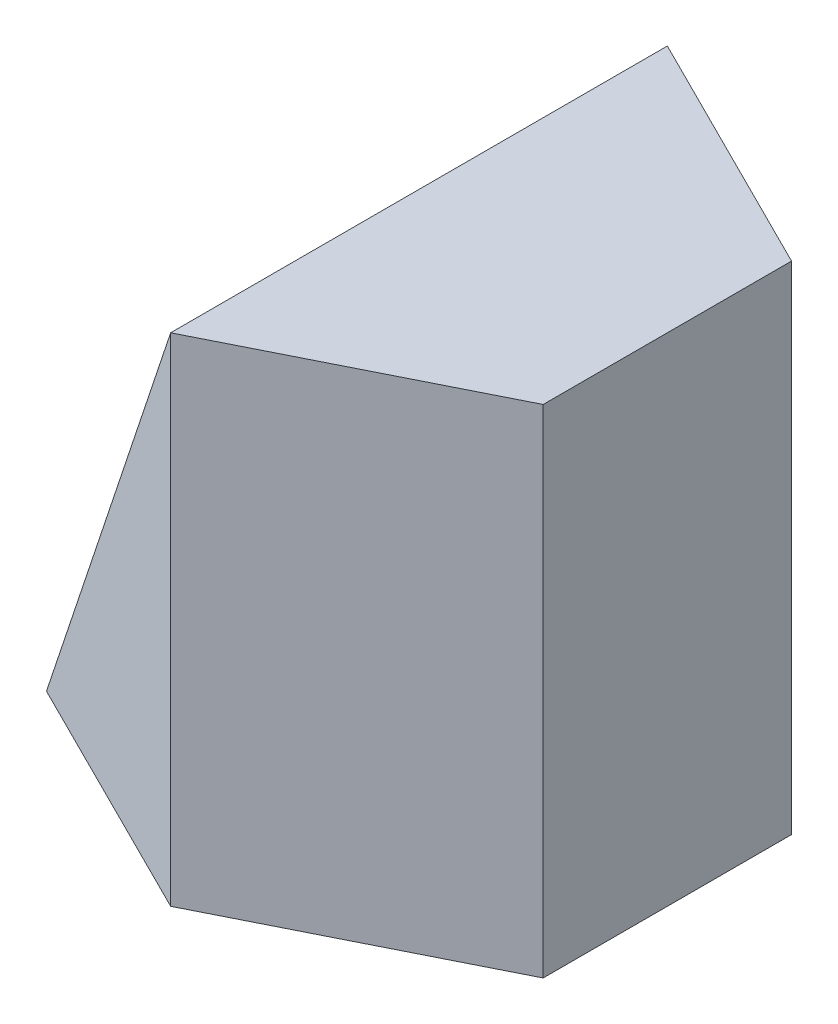
ISO-10303-21;
HEADER;
FILE_DESCRIPTION(('STEP AP214'),'2;1');
FILE_NAME('part.step','',(''),(''),'','','');
FILE_SCHEMA(('AUTOMOTIVE_DESIGN { 1 0 10303 214 1 1 1 1 }'));
ENDSEC;
DATA;
#1=APPLICATION_CONTEXT('core data for automotive mechanical design processes');
#2=APPLICATION_PROTOCOL_DEFINITION('international standard','automotive_design',2000,#1);
#3=PRODUCT_CONTEXT('',#1,'mechanical');
#4=PRODUCT('Part','Part','',(#3));
#5=PRODUCT_RELATED_PRODUCT_CATEGORY('part','',(#4));
#6=PRODUCT_DEFINITION_FORMATION('','',#4);
#7=PRODUCT_DEFINITION_CONTEXT('part definition',#1,'design');
#8=PRODUCT_DEFINITION('design','',#6,#7);
#9=PRODUCT_DEFINITION_SHAPE('','',#8);
#10=(LENGTH_UNIT() NAMED_UNIT(*) SI_UNIT(.MILLI.,.METRE.));
#11=(NAMED_UNIT(*) PLANE_ANGLE_UNIT() SI_UNIT($,.RADIAN.));
#12=(NAMED_UNIT(*) SI_UNIT($,.STERADIAN.) SOLID_ANGLE_UNIT());
#13=UNCERTAINTY_MEASURE_WITH_UNIT(LENGTH_MEASURE(1.E-05),#10,'distance_accuracy_value','');
#14=(GEOMETRIC_REPRESENTATION_CONTEXT(3) GLOBAL_UNCERTAINTY_ASSIGNED_CONTEXT((#13)) GLOBAL_UNIT_ASSIGNED_CONTEXT((#10,
#11,#12)) REPRESENTATION_CONTEXT('',''));
#15=CARTESIAN_POINT('',(0.,0.,0.));
#16=DIRECTION('',(0.,0.,1.));
#17=DIRECTION('',(1.,0.,0.));
#18=AXIS2_PLACEMENT_3D('',#15,#16,#17);
#19=CARTESIAN_POINT('',(0.,0.,40.));
#20=DIRECTION('',(0.,1.,0.));
#21=DIRECTION('',(0.,0.,1.));
#22=AXIS2_PLACEMENT_3D('',#19,#20,#21);
#23=PLANE('',#22);
#24=DIRECTION('',(0.894427190999916,0.,0.447213595499958));
#25=VECTOR('',#24,1.);
#26=CARTESIAN_POINT('',(4.,0.,-8.));
#27=LINE('',#26,#25);
#28=CARTESIAN_POINT('',(20.,0.,0.));
#29=VERTEX_POINT('',#28);
#30=CARTESIAN_POINT('',(40.,0.,10.));
#31=VERTEX_POINT('',#30);
#32=EDGE_CURVE('E118',#29,#31,#27,.T.);
#33=ORIENTED_EDGE('',*,*,#32,.T.);
#34=DIRECTION('',(0.,0.,-1.));
#35=VECTOR('',#34,1.);
#36=CARTESIAN_POINT('',(40.,0.,40.));
#37=LINE('',#36,#35);
#38=CARTESIAN_POINT('',(40.,0.,30.));
#39=VERTEX_POINT('',#38);
#40=EDGE_CURVE('E129',#39,#31,#37,.T.);
#41=ORIENTED_EDGE('',*,*,#40,.F.);
#42=DIRECTION('',(0.894427190999916,0.,-0.447213595499958));
#43=VECTOR('',#42,1.);
#44=CARTESIAN_POINT('',(20.,0.,40.));
#45=LINE('',#44,#43);
#46=CARTESIAN_POINT('',(20.,0.,40.));
#47=VERTEX_POINT('',#46);
#48=EDGE_CURVE('E161',#47,#39,#45,.T.);
#49=ORIENTED_EDGE('',*,*,#48,.F.);
#50=DIRECTION('',(0.894427190999916,0.,0.447213595499958));
#51=VECTOR('',#50,1.);
#52=CARTESIAN_POINT('',(-12.,0.,24.));
#53=LINE('',#52,#51);
#54=CARTESIAN_POINT('',(0.,0.,30.));
#55=VERTEX_POINT('',#54);
#56=EDGE_CURVE('E154',#55,#47,#53,.T.);
#57=ORIENTED_EDGE('',*,*,#56,.F.);
#58=DIRECTION('',(0.,0.,-1.));
#59=VECTOR('',#58,1.);
#60=CARTESIAN_POINT('',(0.,0.,40.));
#61=LINE('',#60,#59);
#62=CARTESIAN_POINT('',(0.,0.,10.));
#63=VERTEX_POINT('',#62);
#64=EDGE_CURVE('E135',#55,#63,#61,.T.);
#65=ORIENTED_EDGE('',*,*,#64,.T.);
#66=DIRECTION('',(-0.894427190999916,0.,0.447213595499958));
#67=VECTOR('',#66,1.);
#68=CARTESIAN_POINT('',(4.,0.,8.));
#69=LINE('',#68,#67);
#70=EDGE_CURVE('E83',#29,#63,#69,.T.);
#71=ORIENTED_EDGE('',*,*,#70,.F.);
#72=EDGE_LOOP('',(#33,#41,#49,#57,#65,#71));
#73=FACE_BOUND('',#72,.T.);
#74=ADVANCED_FACE('F69',(#73),#23,.F.);
#75=CARTESIAN_POINT('',(40.,0.,40.));
#76=DIRECTION('',(-1.,0.,0.));
#77=DIRECTION('',(0.,0.,1.));
#78=AXIS2_PLACEMENT_3D('',#75,#76,#77);
#79=PLANE('',#78);
#80=DIRECTION('',(0.,-1.,0.));
#81=VECTOR('',#80,1.);
#82=CARTESIAN_POINT('',(40.,40.,10.));
#83=LINE('',#82,#81);
#84=CARTESIAN_POINT('',(40.,40.,10.));
#85=VERTEX_POINT('',#84);
#86=EDGE_CURVE('E115',#85,#31,#83,.T.);
#87=ORIENTED_EDGE('',*,*,#86,.F.);
#88=DIRECTION('',(0.,0.,-1.));
#89=VECTOR('',#88,1.);
#90=CARTESIAN_POINT('',(40.,40.,40.));
#91=LINE('',#90,#89);
#92=CARTESIAN_POINT('',(40.,40.,30.));
#93=VERTEX_POINT('',#92);
#94=EDGE_CURVE('E136',#93,#85,#91,.T.);
#95=ORIENTED_EDGE('',*,*,#94,.F.);
#96=DIRECTION('',(0.,-1.,0.));
#97=VECTOR('',#96,1.);
#98=CARTESIAN_POINT('',(40.,40.,30.));
#99=LINE('',#98,#97);
#100=EDGE_CURVE('E134',#93,#39,#99,.T.);
#101=ORIENTED_EDGE('',*,*,#100,.T.);
#102=ORIENTED_EDGE('',*,*,#40,.T.);
#103=EDGE_LOOP('',(#87,#95,#101,#102));
#104=FACE_BOUND('',#103,.T.);
#105=ADVANCED_FACE('F133',(#104),#79,.F.);
#106=CARTESIAN_POINT('',(0.,40.,40.));
#107=DIRECTION('',(0.,-1.,0.));
#108=DIRECTION('',(0.,0.,-1.));
#109=AXIS2_PLACEMENT_3D('',#106,#107,#108);
#110=PLANE('',#109);
#111=DIRECTION('',(0.894427190999916,0.,0.447213595499958));
#112=VECTOR('',#111,1.);
#113=CARTESIAN_POINT('',(4.,40.,-8.));
#114=LINE('',#113,#112);
#115=CARTESIAN_POINT('',(20.,40.,0.));
#116=VERTEX_POINT('',#115);
#117=EDGE_CURVE('E120',#116,#85,#114,.T.);
#118=ORIENTED_EDGE('',*,*,#117,.F.);
#119=DIRECTION('',(0.,0.,1.));
#120=VECTOR('',#119,1.);
#121=CARTESIAN_POINT('',(20.,40.,0.));
#122=LINE('',#121,#120);
#123=CARTESIAN_POINT('',(20.,40.,40.));
#124=VERTEX_POINT('',#123);
#125=EDGE_CURVE('E139',#116,#124,#122,.T.);
#126=ORIENTED_EDGE('',*,*,#125,.T.);
#127=DIRECTION('',(0.894427190999916,0.,-0.447213595499958));
#128=VECTOR('',#127,1.);
#129=CARTESIAN_POINT('',(20.,40.,40.));
#130=LINE('',#129,#128);
#131=EDGE_CURVE('E90',#124,#93,#130,.T.);
#132=ORIENTED_EDGE('',*,*,#131,.T.);
#133=ORIENTED_EDGE('',*,*,#94,.T.);
#134=EDGE_LOOP('',(#118,#126,#132,#133));
#135=FACE_BOUND('',#134,.T.);
#136=ADVANCED_FACE('F152',(#135),#110,.F.);
#137=CARTESIAN_POINT('',(0.,0.,0.));
#138=DIRECTION('',(0.894427190999916,-0.447213595499958,0.));
#139=DIRECTION('',(0.447213595499958,0.894427190999916,0.));
#140=AXIS2_PLACEMENT_3D('',#137,#138,#139);
#141=PLANE('',#140);
#142=ORIENTED_EDGE('',*,*,#125,.F.);
#143=DIRECTION('',(-0.436435780471985,-0.872871560943969,0.218217890235992));
#144=VECTOR('',#143,1.);
#145=CARTESIAN_POINT('',(0.952380952380952,1.9047619047619,9.52380952380953));
#146=LINE('',#145,#144);
#147=EDGE_CURVE('E12',#116,#63,#146,.T.);
#148=ORIENTED_EDGE('',*,*,#147,.T.);
#149=ORIENTED_EDGE('',*,*,#64,.F.);
#150=DIRECTION('',(0.436435780471985,0.872871560943969,0.218217890235992));
#151=VECTOR('',#150,1.);
#152=CARTESIAN_POINT('',(-2.85714285714286,-5.71428571428571,28.5714285714286));
#153=LINE('',#152,#151);
#154=EDGE_CURVE('E76',#55,#124,#153,.T.);
#155=ORIENTED_EDGE('',*,*,#154,.T.);
#156=EDGE_LOOP('',(#142,#148,#149,#155));
#157=FACE_BOUND('',#156,.T.);
#158=ADVANCED_FACE('F147',(#157),#141,.F.);
#159=CARTESIAN_POINT('',(-12.,40.,24.));
#160=DIRECTION('',(0.447213595499958,0.,-0.894427190999916));
#161=DIRECTION('',(-0.894427190999916,0.,-0.447213595499958));
#162=AXIS2_PLACEMENT_3D('',#159,#160,#161);
#163=PLANE('',#162);
#164=ORIENTED_EDGE('',*,*,#56,.T.);
#165=DIRECTION('',(0.,-1.,0.));
#166=VECTOR('',#165,1.);
#167=CARTESIAN_POINT('',(20.,40.,40.));
#168=LINE('',#167,#166);
#169=EDGE_CURVE('E153',#124,#47,#168,.T.);
#170=ORIENTED_EDGE('',*,*,#169,.F.);
#171=ORIENTED_EDGE('',*,*,#154,.F.);
#172=EDGE_LOOP('',(#164,#170,#171));
#173=FACE_BOUND('',#172,.T.);
#174=ADVANCED_FACE('F166',(#173),#163,.F.);
#175=CARTESIAN_POINT('',(4.,40.,8.));
#176=DIRECTION('',(0.447213595499958,0.,0.894427190999916));
#177=DIRECTION('',(0.894427190999916,0.,-0.447213595499958));
#178=AXIS2_PLACEMENT_3D('',#175,#176,#177);
#179=PLANE('',#178);
#180=DIRECTION('',(0.,-1.,0.));
#181=VECTOR('',#180,1.);
#182=CARTESIAN_POINT('',(20.,40.,0.));
#183=LINE('',#182,#181);
#184=EDGE_CURVE('E158',#116,#29,#183,.T.);
#185=ORIENTED_EDGE('',*,*,#184,.T.);
#186=ORIENTED_EDGE('',*,*,#70,.T.);
#187=ORIENTED_EDGE('',*,*,#147,.F.);
#188=EDGE_LOOP('',(#185,#186,#187));
#189=FACE_BOUND('',#188,.T.);
#190=ADVANCED_FACE('F168',(#189),#179,.F.);
#191=CARTESIAN_POINT('',(20.,40.,40.));
#192=DIRECTION('',(-0.447213595499958,0.,-0.894427190999916));
#193=DIRECTION('',(-0.894427190999916,0.,0.447213595499958));
#194=AXIS2_PLACEMENT_3D('',#191,#192,#193);
#195=PLANE('',#194);
#196=ORIENTED_EDGE('',*,*,#48,.T.);
#197=ORIENTED_EDGE('',*,*,#100,.F.);
#198=ORIENTED_EDGE('',*,*,#131,.F.);
#199=ORIENTED_EDGE('',*,*,#169,.T.);
#200=EDGE_LOOP('',(#196,#197,#198,#199));
#201=FACE_BOUND('',#200,.T.);
#202=ADVANCED_FACE('F165',(#201),#195,.F.);
#203=CARTESIAN_POINT('',(4.,40.,-8.));
#204=DIRECTION('',(0.447213595499958,0.,-0.894427190999916));
#205=DIRECTION('',(-0.894427190999916,0.,-0.447213595499958));
#206=AXIS2_PLACEMENT_3D('',#203,#204,#205);
#207=PLANE('',#206);
#208=ORIENTED_EDGE('',*,*,#32,.F.);
#209=ORIENTED_EDGE('',*,*,#184,.F.);
#210=ORIENTED_EDGE('',*,*,#117,.T.);
#211=ORIENTED_EDGE('',*,*,#86,.T.);
#212=EDGE_LOOP('',(#208,#209,#210,#211));
#213=FACE_BOUND('',#212,.T.);
#214=ADVANCED_FACE('F117',(#213),#207,.T.);
#215=CLOSED_SHELL('',(#74,#105,#136,#158,#174,#190,#202,#214));
#216=MANIFOLD_SOLID_BREP('B2',#215);
#217=ADVANCED_BREP_SHAPE_REPRESENTATION('',(#18,#216),#14);
#218=SHAPE_DEFINITION_REPRESENTATION(#9,#217);
ENDSEC;
END-ISO-10303-21;
